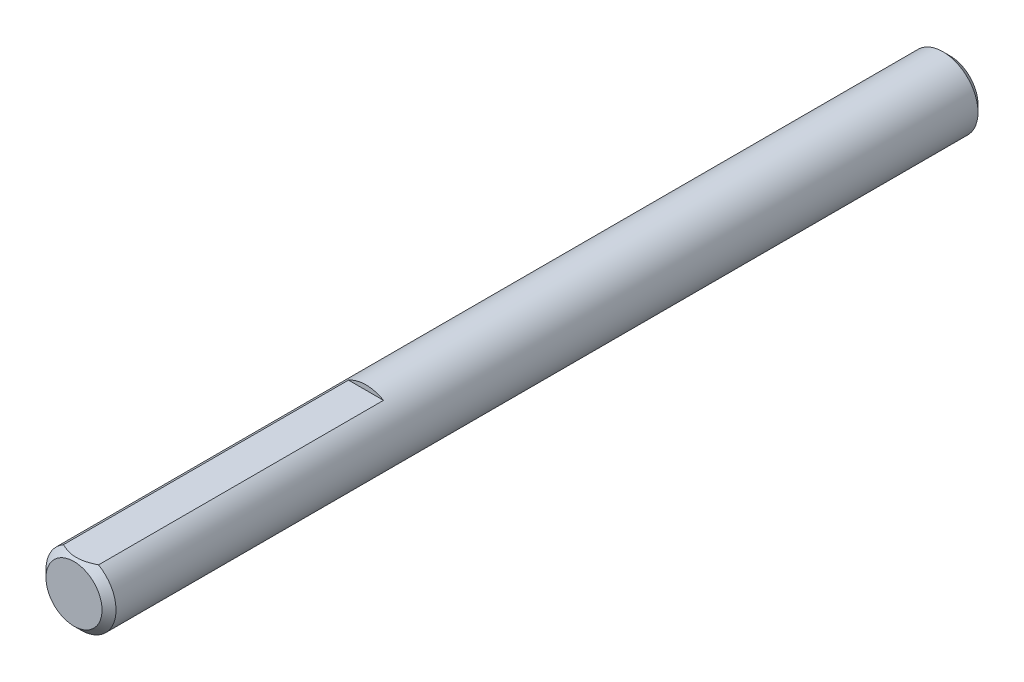
ISO-10303-21;
HEADER;
FILE_DESCRIPTION(('STEP AP214'),'2;1');
FILE_NAME('part.step','',(''),(''),'','','');
FILE_SCHEMA(('AUTOMOTIVE_DESIGN { 1 0 10303 214 1 1 1 1 }'));
ENDSEC;
DATA;
#1=APPLICATION_CONTEXT('core data for automotive mechanical design processes');
#2=APPLICATION_PROTOCOL_DEFINITION('international standard','automotive_design',2000,#1);
#3=PRODUCT_CONTEXT('',#1,'mechanical');
#4=PRODUCT('Part','Part','',(#3));
#5=PRODUCT_RELATED_PRODUCT_CATEGORY('part','',(#4));
#6=PRODUCT_DEFINITION_FORMATION('','',#4);
#7=PRODUCT_DEFINITION_CONTEXT('part definition',#1,'design');
#8=PRODUCT_DEFINITION('design','',#6,#7);
#9=PRODUCT_DEFINITION_SHAPE('','',#8);
#10=(LENGTH_UNIT() NAMED_UNIT(*) SI_UNIT(.MILLI.,.METRE.));
#11=(NAMED_UNIT(*) PLANE_ANGLE_UNIT() SI_UNIT($,.RADIAN.));
#12=(NAMED_UNIT(*) SI_UNIT($,.STERADIAN.) SOLID_ANGLE_UNIT());
#13=UNCERTAINTY_MEASURE_WITH_UNIT(LENGTH_MEASURE(1.E-05),#10,'distance_accuracy_value','');
#14=(GEOMETRIC_REPRESENTATION_CONTEXT(3) GLOBAL_UNCERTAINTY_ASSIGNED_CONTEXT((#13)) GLOBAL_UNIT_ASSIGNED_CONTEXT((#10,
#11,#12)) REPRESENTATION_CONTEXT('',''));
#15=CARTESIAN_POINT('',(0.,0.,0.));
#16=DIRECTION('',(0.,0.,1.));
#17=DIRECTION('',(1.,0.,0.));
#18=AXIS2_PLACEMENT_3D('',#15,#16,#17);
#19=CARTESIAN_POINT('',(0.,0.,38.1));
#20=DIRECTION('',(0.,0.,-1.));
#21=DIRECTION('',(-1.,0.,0.));
#22=AXIS2_PLACEMENT_3D('',#19,#20,#21);
#23=CYLINDRICAL_SURFACE('',#22,3.048);
#24=CARTESIAN_POINT('',(0.,0.,-37.4903999999999));
#25=DIRECTION('',(0.,0.,1.));
#26=DIRECTION('',(1.,0.,0.));
#27=AXIS2_PLACEMENT_3D('',#24,#25,#26);
#28=CIRCLE('',#27,3.048);
#29=CARTESIAN_POINT('',(3.048,0.,-37.4903999999999));
#30=VERTEX_POINT('',#29);
#31=EDGE_CURVE('E77',#30,#30,#28,.T.);
#32=ORIENTED_EDGE('',*,*,#31,.T.);
#33=EDGE_LOOP('',(#32));
#34=FACE_BOUND('',#33,.T.);
#35=DIRECTION('',(0.,0.,-1.));
#36=VECTOR('',#35,1.);
#37=CARTESIAN_POINT('',(1.524,2.63964543073497,38.1));
#38=LINE('',#37,#36);
#39=CARTESIAN_POINT('',(1.524,2.63964543073497,37.4904));
#40=VERTEX_POINT('',#39);
#41=CARTESIAN_POINT('',(1.524,2.63964543073497,12.7));
#42=VERTEX_POINT('',#41);
#43=EDGE_CURVE('E65',#40,#42,#38,.T.);
#44=ORIENTED_EDGE('',*,*,#43,.F.);
#45=CARTESIAN_POINT('',(0.,0.,37.4904));
#46=DIRECTION('',(0.,0.,1.));
#47=DIRECTION('',(1.,0.,0.));
#48=AXIS2_PLACEMENT_3D('',#45,#46,#47);
#49=CIRCLE('',#48,3.048);
#50=CARTESIAN_POINT('',(-1.524,2.63964543073497,37.4904));
#51=VERTEX_POINT('',#50);
#52=EDGE_CURVE('E75',#40,#51,#49,.F.);
#53=ORIENTED_EDGE('',*,*,#52,.T.);
#54=DIRECTION('',(0.,0.,-1.));
#55=VECTOR('',#54,1.);
#56=CARTESIAN_POINT('',(-1.524,2.63964543073497,38.1));
#57=LINE('',#56,#55);
#58=CARTESIAN_POINT('',(-1.524,2.63964543073497,12.7));
#59=VERTEX_POINT('',#58);
#60=EDGE_CURVE('E54',#51,#59,#57,.T.);
#61=ORIENTED_EDGE('',*,*,#60,.T.);
#62=CARTESIAN_POINT('',(0.,0.,12.7));
#63=DIRECTION('',(0.,0.,1.));
#64=DIRECTION('',(1.,0.,0.));
#65=AXIS2_PLACEMENT_3D('',#62,#63,#64);
#66=CIRCLE('',#65,3.048);
#67=EDGE_CURVE('E68',#42,#59,#66,.T.);
#68=ORIENTED_EDGE('',*,*,#67,.F.);
#69=EDGE_LOOP('',(#44,#53,#61,#68));
#70=FACE_BOUND('',#69,.T.);
#71=ADVANCED_FACE('F33',(#34,#70),#23,.T.);
#72=CARTESIAN_POINT('',(0.,0.,38.1));
#73=DIRECTION('',(0.,0.,-1.));
#74=DIRECTION('',(-1.,0.,0.));
#75=AXIS2_PLACEMENT_3D('',#72,#73,#74);
#76=CONICAL_SURFACE('',#75,2.43840000000004,0.785398163397447);
#77=CARTESIAN_POINT('',(0.,0.,38.1));
#78=DIRECTION('',(0.,0.,1.));
#79=DIRECTION('',(1.,0.,0.));
#80=AXIS2_PLACEMENT_3D('',#77,#78,#79);
#81=CIRCLE('',#80,2.43840000000004);
#82=CARTESIAN_POINT('',(2.43840000000004,0.,38.1));
#83=VERTEX_POINT('',#82);
#84=EDGE_CURVE('E47',#83,#83,#81,.T.);
#85=ORIENTED_EDGE('',*,*,#84,.F.);
#86=EDGE_LOOP('',(#85));
#87=FACE_BOUND('',#86,.T.);
#88=ORIENTED_EDGE('',*,*,#52,.F.);
#89=CARTESIAN_POINT('',(-3.09980289814782,2.63964543073497,36.4669744502244));
#90=CARTESIAN_POINT('',(-3.02459183568102,2.63964543073497,36.5242238635642));
#91=CARTESIAN_POINT('',(-2.94896649265214,2.63964543073497,36.580937742744));
#92=CARTESIAN_POINT('',(-2.79672125346067,2.63964543073497,36.6930525289136));
#93=CARTESIAN_POINT('',(-2.72010111846043,2.63964543073497,36.7484531112248));
#94=CARTESIAN_POINT('',(-2.56513980338637,2.63964543073497,36.8580936458929));
#95=CARTESIAN_POINT('',(-2.48678989411612,2.63964543073497,36.9123213019557));
#96=CARTESIAN_POINT('',(-2.32877099157278,2.63964543073497,37.0188129737611));
#97=CARTESIAN_POINT('',(-2.24910209096962,2.63964543073497,37.0710771266194));
#98=CARTESIAN_POINT('',(-2.0834058987574,2.63964543073497,37.1762629163191));
#99=CARTESIAN_POINT('',(-1.99728382583225,2.63964543073497,37.2290360019266));
#100=CARTESIAN_POINT('',(-1.82304868491544,2.63964543073497,37.33118111347));
#101=CARTESIAN_POINT('',(-1.7349358802461,2.63964543073497,37.3805535857615));
#102=CARTESIAN_POINT('',(-1.55667609954172,2.63964543073497,37.4748622128494));
#103=CARTESIAN_POINT('',(-1.46653575285594,2.63964543073497,37.5198108001697));
#104=CARTESIAN_POINT('',(-1.28375718309216,2.63964543073497,37.6042567827271));
#105=CARTESIAN_POINT('',(-1.191120135482,2.63964543073497,37.6437566914505));
#106=CARTESIAN_POINT('',(-1.01150153050319,2.63964543073497,37.7126941797413));
#107=CARTESIAN_POINT('',(-0.924745368565098,2.63964543073497,37.7427130022144));
#108=CARTESIAN_POINT('',(-0.749091585754665,2.63964543073497,37.7957982598565));
#109=CARTESIAN_POINT('',(-0.660193822828288,2.63964543073497,37.8188642324589));
#110=CARTESIAN_POINT('',(-0.482295774031543,2.63964543073497,37.8564367592075));
#111=CARTESIAN_POINT('',(-0.393327787340891,2.63964543073497,37.871093716559));
#112=CARTESIAN_POINT('',(-0.214374077457863,2.63964543073497,37.8915540883483));
#113=CARTESIAN_POINT('',(-0.124388547299881,2.63964543073497,37.8973591545736));
#114=CARTESIAN_POINT('',(0.0521623256656012,2.63964543073497,37.8996571058386));
#115=CARTESIAN_POINT('',(0.138723112850263,2.63964543073497,37.8965069627788));
#116=CARTESIAN_POINT('',(0.311131721830465,2.63964543073497,37.8818705010853));
#117=CARTESIAN_POINT('',(0.39697947542098,2.63964543073497,37.8703833940622));
#118=CARTESIAN_POINT('',(0.568796223383096,2.63964543073497,37.8395150625947));
#119=CARTESIAN_POINT('',(0.654740330283844,2.63964543073497,37.8199973569682));
#120=CARTESIAN_POINT('',(0.824739239005258,2.63964543073497,37.7741233900359));
#121=CARTESIAN_POINT('',(0.908794177045221,2.63964543073497,37.7477676235213));
#122=CARTESIAN_POINT('',(1.17076437773243,2.63964543073497,37.6556443029021));
#123=CARTESIAN_POINT('',(1.34504250252158,2.63964543073497,37.5794970746269));
#124=CARTESIAN_POINT('',(1.60008853910264,2.63964543073497,37.4525318258167));
#125=CARTESIAN_POINT('',(1.68419988849614,2.63964543073497,37.4079865546789));
#126=CARTESIAN_POINT('',(1.85051473406975,2.63964543073497,37.315458468257));
#127=CARTESIAN_POINT('',(1.93271856677236,2.63964543073497,37.2674762655126));
#128=CARTESIAN_POINT('',(2.09140976914306,2.63964543073497,37.1712132895739));
#129=CARTESIAN_POINT('',(2.16797853358848,2.63964543073497,37.1230651766781));
#130=CARTESIAN_POINT('',(2.31980273894396,2.63964543073497,37.0247310890521));
#131=CARTESIAN_POINT('',(2.3950580802065,2.63964543073497,36.9745449606533));
#132=CARTESIAN_POINT('',(2.54381747768283,2.63964543073497,36.8729118000532));
#133=CARTESIAN_POINT('',(2.61733077104599,2.63964543073497,36.821478232103));
#134=CARTESIAN_POINT('',(2.76335083170399,2.63964543073497,36.7172420064163));
#135=CARTESIAN_POINT('',(2.8358578705849,2.63964543073497,36.6644397295767));
#136=CARTESIAN_POINT('',(2.90794340130837,2.63964543073497,36.6110773973593));
#137=B_SPLINE_CURVE_WITH_KNOTS('',3,(#89,#90,#91,#92,#93,#94,#95,#96,#97,#98,#99,#100,#101,#102,
#103,#104,#105,#106,#107,#108,#109,#110,#111,#112,#113,#114,#115,#116,#117,#118,#119,#120,#121,
#122,#123,#124,#125,#126,#127,#128,#129,#130,#131,#132,#133,#134,#135,#136),.UNSPECIFIED.,.F.,
.F.,(4,2,2,2,2,2,2,2,2,2,2,2,2,2,2,2,2,2,2,2,2,2,2,4),(0.,0.283568111300359,0.567205611358836,
0.853037636758031,1.13884966463107,1.44180274146966,1.74471597738573,2.0467520476303,
2.34864831872809,2.6238169410205,2.89900386598879,3.16910167931159,3.43914908545944,
3.69858457241753,3.958044596229,4.22210933380221,4.48615496939396,5.05494788391658,
5.34046078541164,5.62592292800126,5.89723702647241,6.16857162045045,6.43771387324911,
6.70678201418171),.UNSPECIFIED.);
#138=EDGE_CURVE('E11',#40,#51,#137,.F.);
#139=ORIENTED_EDGE('',*,*,#138,.T.);
#140=EDGE_LOOP('',(#88,#139));
#141=FACE_BOUND('',#140,.T.);
#142=ADVANCED_FACE('F35',(#87,#141),#76,.T.);
#143=CARTESIAN_POINT('',(0.,0.,38.1));
#144=DIRECTION('',(0.,0.,1.));
#145=DIRECTION('',(1.,0.,0.));
#146=AXIS2_PLACEMENT_3D('',#143,#144,#145);
#147=PLANE('',#146);
#148=ORIENTED_EDGE('',*,*,#84,.T.);
#149=EDGE_LOOP('',(#148));
#150=FACE_BOUND('',#149,.T.);
#151=ADVANCED_FACE('F88',(#150),#147,.T.);
#152=CARTESIAN_POINT('',(0.,0.,-38.1));
#153=DIRECTION('',(0.,0.,1.));
#154=DIRECTION('',(1.,0.,0.));
#155=AXIS2_PLACEMENT_3D('',#152,#153,#154);
#156=PLANE('',#155);
#157=CARTESIAN_POINT('',(0.,0.,-38.1));
#158=DIRECTION('',(0.,0.,1.));
#159=DIRECTION('',(1.,0.,0.));
#160=AXIS2_PLACEMENT_3D('',#157,#158,#159);
#161=CIRCLE('',#160,2.43839999999991);
#162=CARTESIAN_POINT('',(2.43839999999991,0.,-38.1));
#163=VERTEX_POINT('',#162);
#164=EDGE_CURVE('E83',#163,#163,#161,.F.);
#165=ORIENTED_EDGE('',*,*,#164,.T.);
#166=EDGE_LOOP('',(#165));
#167=FACE_BOUND('',#166,.T.);
#168=ADVANCED_FACE('F96',(#167),#156,.F.);
#169=CARTESIAN_POINT('',(0.,0.,-37.4903999999999));
#170=DIRECTION('',(0.,0.,1.));
#171=DIRECTION('',(1.,0.,0.));
#172=AXIS2_PLACEMENT_3D('',#169,#170,#171);
#173=CONICAL_SURFACE('',#172,3.048,0.785398163397452);
#174=ORIENTED_EDGE('',*,*,#164,.F.);
#175=EDGE_LOOP('',(#174));
#176=FACE_BOUND('',#175,.T.);
#177=ORIENTED_EDGE('',*,*,#31,.F.);
#178=EDGE_LOOP('',(#177));
#179=FACE_BOUND('',#178,.T.);
#180=ADVANCED_FACE('F103',(#176,#179),#173,.T.);
#181=CARTESIAN_POINT('',(-1.524,2.63964543073497,38.1));
#182=DIRECTION('',(0.,1.,0.));
#183=DIRECTION('',(0.,0.,1.));
#184=AXIS2_PLACEMENT_3D('',#181,#182,#183);
#185=PLANE('',#184);
#186=ORIENTED_EDGE('',*,*,#43,.T.);
#187=DIRECTION('',(1.,0.,0.));
#188=VECTOR('',#187,1.);
#189=CARTESIAN_POINT('',(-1.524,2.63964543073497,12.7));
#190=LINE('',#189,#188);
#191=EDGE_CURVE('E62',#59,#42,#190,.T.);
#192=ORIENTED_EDGE('',*,*,#191,.F.);
#193=ORIENTED_EDGE('',*,*,#60,.F.);
#194=ORIENTED_EDGE('',*,*,#138,.F.);
#195=EDGE_LOOP('',(#186,#192,#193,#194));
#196=FACE_BOUND('',#195,.T.);
#197=ADVANCED_FACE('F64',(#196),#185,.T.);
#198=CARTESIAN_POINT('',(0.,0.,12.7));
#199=DIRECTION('',(0.,0.,1.));
#200=DIRECTION('',(1.,0.,0.));
#201=AXIS2_PLACEMENT_3D('',#198,#199,#200);
#202=PLANE('',#201);
#203=ORIENTED_EDGE('',*,*,#67,.T.);
#204=ORIENTED_EDGE('',*,*,#191,.T.);
#205=EDGE_LOOP('',(#203,#204));
#206=FACE_BOUND('',#205,.T.);
#207=ADVANCED_FACE('F70',(#206),#202,.T.);
#208=CLOSED_SHELL('',(#71,#142,#151,#168,#180,#197,#207));
#209=MANIFOLD_SOLID_BREP('B2',#208);
#210=ADVANCED_BREP_SHAPE_REPRESENTATION('',(#18,#209),#14);
#211=SHAPE_DEFINITION_REPRESENTATION(#9,#210);
ENDSEC;
END-ISO-10303-21;
